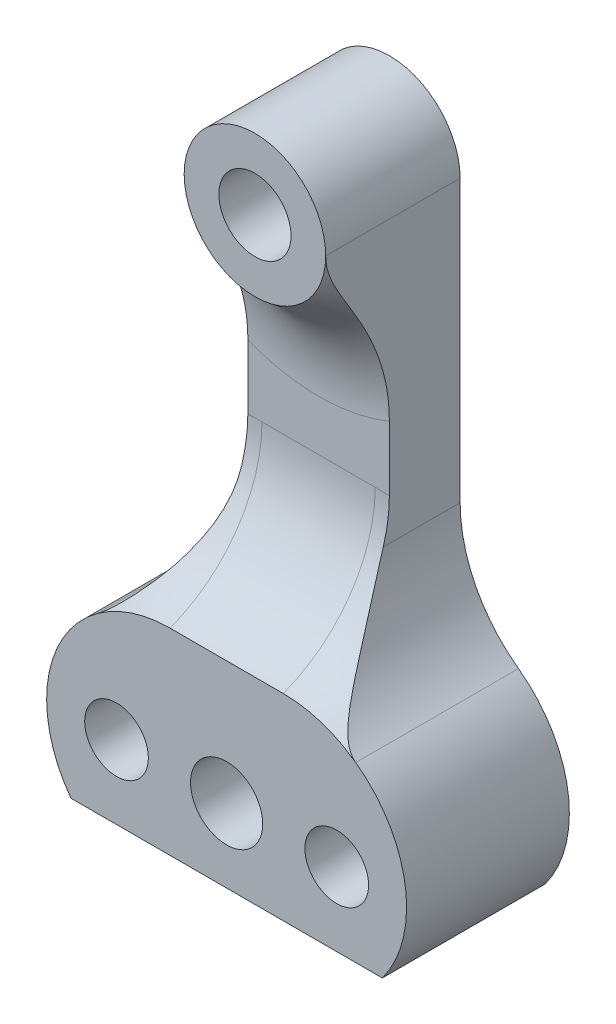
ISO-10303-21;
HEADER;
FILE_DESCRIPTION(('STEP AP214'),'2;1');
FILE_NAME('part.step','',(''),(''),'','','');
FILE_SCHEMA(('AUTOMOTIVE_DESIGN { 1 0 10303 214 1 1 1 1 }'));
ENDSEC;
DATA;
#1=APPLICATION_CONTEXT('core data for automotive mechanical design processes');
#2=APPLICATION_PROTOCOL_DEFINITION('international standard','automotive_design',2000,#1);
#3=PRODUCT_CONTEXT('',#1,'mechanical');
#4=PRODUCT('Part','Part','',(#3));
#5=PRODUCT_RELATED_PRODUCT_CATEGORY('part','',(#4));
#6=PRODUCT_DEFINITION_FORMATION('','',#4);
#7=PRODUCT_DEFINITION_CONTEXT('part definition',#1,'design');
#8=PRODUCT_DEFINITION('design','',#6,#7);
#9=PRODUCT_DEFINITION_SHAPE('','',#8);
#10=(LENGTH_UNIT() NAMED_UNIT(*) SI_UNIT(.MILLI.,.METRE.));
#11=(NAMED_UNIT(*) PLANE_ANGLE_UNIT() SI_UNIT($,.RADIAN.));
#12=(NAMED_UNIT(*) SI_UNIT($,.STERADIAN.) SOLID_ANGLE_UNIT());
#13=UNCERTAINTY_MEASURE_WITH_UNIT(LENGTH_MEASURE(1.E-05),#10,'distance_accuracy_value','');
#14=(GEOMETRIC_REPRESENTATION_CONTEXT(3) GLOBAL_UNCERTAINTY_ASSIGNED_CONTEXT((#13)) GLOBAL_UNIT_ASSIGNED_CONTEXT((#10,
#11,#12)) REPRESENTATION_CONTEXT('',''));
#15=CARTESIAN_POINT('',(0.,0.,0.));
#16=DIRECTION('',(0.,0.,1.));
#17=DIRECTION('',(1.,0.,0.));
#18=AXIS2_PLACEMENT_3D('',#15,#16,#17);
#19=CARTESIAN_POINT('',(0.,0.,0.));
#20=DIRECTION('',(0.,0.,1.));
#21=DIRECTION('',(1.,0.,0.));
#22=AXIS2_PLACEMENT_3D('',#19,#20,#21);
#23=CYLINDRICAL_SURFACE('',#22,2.55);
#24=CARTESIAN_POINT('',(0.,0.,9.5));
#25=DIRECTION('',(0.,0.,1.));
#26=DIRECTION('',(1.,0.,0.));
#27=AXIS2_PLACEMENT_3D('',#24,#25,#26);
#28=CIRCLE('',#27,2.55);
#29=CARTESIAN_POINT('',(2.55,0.,9.5));
#30=VERTEX_POINT('',#29);
#31=EDGE_CURVE('E163',#30,#30,#28,.F.);
#32=ORIENTED_EDGE('',*,*,#31,.F.);
#33=EDGE_LOOP('',(#32));
#34=FACE_BOUND('',#33,.T.);
#35=CARTESIAN_POINT('',(0.,0.,0.));
#36=DIRECTION('',(0.,0.,1.));
#37=DIRECTION('',(1.,0.,0.));
#38=AXIS2_PLACEMENT_3D('',#35,#36,#37);
#39=CIRCLE('',#38,2.55);
#40=CARTESIAN_POINT('',(2.55,0.,0.));
#41=VERTEX_POINT('',#40);
#42=EDGE_CURVE('E189',#41,#41,#39,.T.);
#43=ORIENTED_EDGE('',*,*,#42,.F.);
#44=EDGE_LOOP('',(#43));
#45=FACE_BOUND('',#44,.T.);
#46=ADVANCED_FACE('F38',(#34,#45),#23,.F.);
#47=CARTESIAN_POINT('',(0.,0.,5.));
#48=DIRECTION('',(0.,0.,1.));
#49=DIRECTION('',(1.,0.,0.));
#50=AXIS2_PLACEMENT_3D('',#47,#48,#49);
#51=PLANE('',#50);
#52=DIRECTION('',(0.,-1.,0.));
#53=VECTOR('',#52,1.);
#54=CARTESIAN_POINT('',(5.,0.,5.));
#55=LINE('',#54,#53);
#56=CARTESIAN_POINT('',(5.,-12.3800834182347,5.));
#57=VERTEX_POINT('',#56);
#58=CARTESIAN_POINT('',(5.,-16.9430334058623,5.));
#59=VERTEX_POINT('',#58);
#60=EDGE_CURVE('E150',#57,#59,#55,.T.);
#61=ORIENTED_EDGE('',*,*,#60,.F.);
#62=CARTESIAN_POINT('',(0.,0.,5.));
#63=DIRECTION('',(0.,0.,1.));
#64=DIRECTION('',(1.,0.,0.));
#65=AXIS2_PLACEMENT_3D('',#62,#63,#64);
#66=CIRCLE('',#65,13.351646544245);
#67=CARTESIAN_POINT('',(-5.,-12.3800834182347,5.));
#68=VERTEX_POINT('',#67);
#69=EDGE_CURVE('E260',#57,#68,#66,.F.);
#70=ORIENTED_EDGE('',*,*,#69,.T.);
#71=DIRECTION('',(0.,1.,0.));
#72=VECTOR('',#71,1.);
#73=CARTESIAN_POINT('',(-5.,0.,5.));
#74=LINE('',#73,#72);
#75=CARTESIAN_POINT('',(-5.,-16.9430334058623,5.));
#76=VERTEX_POINT('',#75);
#77=EDGE_CURVE('E151',#76,#68,#74,.T.);
#78=ORIENTED_EDGE('',*,*,#77,.F.);
#79=CARTESIAN_POINT('',(-4.,-35.,5.));
#80=DIRECTION('',(0.,0.,1.));
#81=DIRECTION('',(1.,0.,0.));
#82=AXIS2_PLACEMENT_3D('',#79,#80,#81);
#83=CIRCLE('',#82,18.0846355390925);
#84=CARTESIAN_POINT('',(-4.,-16.9153644609075,5.));
#85=VERTEX_POINT('',#84);
#86=EDGE_CURVE('E210',#76,#85,#83,.F.);
#87=ORIENTED_EDGE('',*,*,#86,.T.);
#88=DIRECTION('',(-1.,0.,0.));
#89=VECTOR('',#88,1.);
#90=CARTESIAN_POINT('',(4.,-16.9153644609075,5.));
#91=LINE('',#90,#89);
#92=CARTESIAN_POINT('',(4.,-16.9153644609075,5.));
#93=VERTEX_POINT('',#92);
#94=EDGE_CURVE('E208',#85,#93,#91,.F.);
#95=ORIENTED_EDGE('',*,*,#94,.T.);
#96=CARTESIAN_POINT('',(4.,-35.,5.));
#97=DIRECTION('',(0.,0.,1.));
#98=DIRECTION('',(1.,0.,0.));
#99=AXIS2_PLACEMENT_3D('',#96,#97,#98);
#100=CIRCLE('',#99,18.0846355390925);
#101=EDGE_CURVE('E212',#93,#59,#100,.F.);
#102=ORIENTED_EDGE('',*,*,#101,.T.);
#103=EDGE_LOOP('',(#61,#70,#78,#87,#95,#102));
#104=FACE_BOUND('',#103,.T.);
#105=ADVANCED_FACE('F292',(#104),#51,.T.);
#106=CARTESIAN_POINT('',(0.,0.,0.));
#107=DIRECTION('',(0.,0.,1.));
#108=DIRECTION('',(1.,0.,0.));
#109=AXIS2_PLACEMENT_3D('',#106,#107,#108);
#110=PLANE('',#109);
#111=CARTESIAN_POINT('',(-7.78,-35.,0.));
#112=DIRECTION('',(0.,0.,-1.));
#113=DIRECTION('',(-1.,0.,0.));
#114=AXIS2_PLACEMENT_3D('',#111,#112,#113);
#115=CIRCLE('',#114,4.);
#116=CARTESIAN_POINT('',(-11.78,-35.,0.));
#117=VERTEX_POINT('',#116);
#118=EDGE_CURVE('E511',#117,#117,#115,.T.);
#119=ORIENTED_EDGE('',*,*,#118,.F.);
#120=EDGE_LOOP('',(#119));
#121=FACE_BOUND('',#120,.T.);
#122=CARTESIAN_POINT('',(7.78,-35.,0.));
#123=DIRECTION('',(0.,0.,-1.));
#124=DIRECTION('',(-1.,0.,0.));
#125=AXIS2_PLACEMENT_3D('',#122,#123,#124);
#126=CIRCLE('',#125,4.);
#127=CARTESIAN_POINT('',(3.78,-35.,0.));
#128=VERTEX_POINT('',#127);
#129=EDGE_CURVE('E521',#128,#128,#126,.T.);
#130=ORIENTED_EDGE('',*,*,#129,.F.);
#131=EDGE_LOOP('',(#130));
#132=FACE_BOUND('',#131,.T.);
#133=CARTESIAN_POINT('',(-4.,-35.,0.));
#134=DIRECTION('',(0.,0.,1.));
#135=DIRECTION('',(1.,0.,0.));
#136=AXIS2_PLACEMENT_3D('',#133,#134,#135);
#137=CIRCLE('',#136,8.71713854149488);
#138=CARTESIAN_POINT('',(-11.0026388508011,-40.1914885607951,0.));
#139=VERTEX_POINT('',#138);
#140=CARTESIAN_POINT('',(-9.12303329613466,-27.9471258200425,0.));
#141=VERTEX_POINT('',#140);
#142=EDGE_CURVE('E164',#139,#141,#137,.F.);
#143=ORIENTED_EDGE('',*,*,#142,.T.);
#144=CARTESIAN_POINT('',(-15.,-19.8563123651631,0.));
#145=DIRECTION('',(0.,0.,1.));
#146=DIRECTION('',(1.,0.,0.));
#147=AXIS2_PLACEMENT_3D('',#144,#145,#146);
#148=CIRCLE('',#147,10.);
#149=CARTESIAN_POINT('',(-5.,-19.8563123651631,0.));
#150=VERTEX_POINT('',#149);
#151=EDGE_CURVE('E141',#141,#150,#148,.T.);
#152=ORIENTED_EDGE('',*,*,#151,.T.);
#153=DIRECTION('',(0.,1.,0.));
#154=VECTOR('',#153,1.);
#155=CARTESIAN_POINT('',(-5.,0.,0.));
#156=LINE('',#155,#154);
#157=CARTESIAN_POINT('',(-5.,0.,0.));
#158=VERTEX_POINT('',#157);
#159=EDGE_CURVE('E134',#150,#158,#156,.T.);
#160=ORIENTED_EDGE('',*,*,#159,.T.);
#161=CARTESIAN_POINT('',(0.,0.,0.));
#162=DIRECTION('',(0.,0.,-1.));
#163=DIRECTION('',(-1.,0.,0.));
#164=AXIS2_PLACEMENT_3D('',#161,#162,#163);
#165=CIRCLE('',#164,5.);
#166=CARTESIAN_POINT('',(5.,0.,0.));
#167=VERTEX_POINT('',#166);
#168=EDGE_CURVE('E139',#158,#167,#165,.T.);
#169=ORIENTED_EDGE('',*,*,#168,.T.);
#170=DIRECTION('',(0.,-1.,0.));
#171=VECTOR('',#170,1.);
#172=CARTESIAN_POINT('',(5.,0.,0.));
#173=LINE('',#172,#171);
#174=CARTESIAN_POINT('',(5.,-19.8563123651631,0.));
#175=VERTEX_POINT('',#174);
#176=EDGE_CURVE('E145',#167,#175,#173,.T.);
#177=ORIENTED_EDGE('',*,*,#176,.T.);
#178=CARTESIAN_POINT('',(15.,-19.8563123651631,0.));
#179=DIRECTION('',(0.,0.,1.));
#180=DIRECTION('',(1.,0.,0.));
#181=AXIS2_PLACEMENT_3D('',#178,#179,#180);
#182=CIRCLE('',#181,10.);
#183=CARTESIAN_POINT('',(9.12303329613466,-27.9471258200425,0.));
#184=VERTEX_POINT('',#183);
#185=EDGE_CURVE('E205',#175,#184,#182,.T.);
#186=ORIENTED_EDGE('',*,*,#185,.T.);
#187=CARTESIAN_POINT('',(4.,-35.,0.));
#188=DIRECTION('',(0.,0.,1.));
#189=DIRECTION('',(1.,0.,0.));
#190=AXIS2_PLACEMENT_3D('',#187,#188,#189);
#191=CIRCLE('',#190,8.71713854149488);
#192=CARTESIAN_POINT('',(11.0026388508011,-40.1914885607951,0.));
#193=VERTEX_POINT('',#192);
#194=EDGE_CURVE('E165',#184,#193,#191,.F.);
#195=ORIENTED_EDGE('',*,*,#194,.T.);
#196=DIRECTION('',(-1.,0.,0.));
#197=VECTOR('',#196,1.);
#198=CARTESIAN_POINT('',(-11.0026388508011,-40.1914885607951,0.));
#199=LINE('',#198,#197);
#200=EDGE_CURVE('E161',#193,#139,#199,.T.);
#201=ORIENTED_EDGE('',*,*,#200,.T.);
#202=EDGE_LOOP('',(#143,#152,#160,#169,#177,#186,#195,#201));
#203=FACE_BOUND('',#202,.T.);
#204=CARTESIAN_POINT('',(0.,-35.,0.));
#205=DIRECTION('',(0.,0.,1.));
#206=DIRECTION('',(1.,0.,0.));
#207=AXIS2_PLACEMENT_3D('',#204,#205,#206);
#208=CIRCLE('',#207,2.55);
#209=CARTESIAN_POINT('',(2.55,-35.,0.));
#210=VERTEX_POINT('',#209);
#211=EDGE_CURVE('E188',#210,#210,#208,.T.);
#212=ORIENTED_EDGE('',*,*,#211,.T.);
#213=EDGE_LOOP('',(#212));
#214=FACE_BOUND('',#213,.T.);
#215=ORIENTED_EDGE('',*,*,#42,.T.);
#216=EDGE_LOOP('',(#215));
#217=FACE_BOUND('',#216,.T.);
#218=ADVANCED_FACE('F136',(#121,#132,#203,#214,#217),#110,.F.);
#219=CARTESIAN_POINT('',(0.,-35.,0.));
#220=DIRECTION('',(0.,0.,1.));
#221=DIRECTION('',(1.,0.,0.));
#222=AXIS2_PLACEMENT_3D('',#219,#220,#221);
#223=CYLINDRICAL_SURFACE('',#222,2.55);
#224=ORIENTED_EDGE('',*,*,#211,.F.);
#225=EDGE_LOOP('',(#224));
#226=FACE_BOUND('',#225,.T.);
#227=CARTESIAN_POINT('',(0.,-35.,11.5));
#228=DIRECTION('',(0.,0.,-1.));
#229=DIRECTION('',(-1.,0.,0.));
#230=AXIS2_PLACEMENT_3D('',#227,#228,#229);
#231=CIRCLE('',#230,2.55);
#232=CARTESIAN_POINT('',(-2.55,-35.,11.5));
#233=VERTEX_POINT('',#232);
#234=EDGE_CURVE('E185',#233,#233,#231,.T.);
#235=ORIENTED_EDGE('',*,*,#234,.F.);
#236=EDGE_LOOP('',(#235));
#237=FACE_BOUND('',#236,.T.);
#238=ADVANCED_FACE('F353',(#226,#237),#223,.F.);
#239=CARTESIAN_POINT('',(0.,-35.,11.5));
#240=DIRECTION('',(0.,0.,1.));
#241=DIRECTION('',(1.,0.,0.));
#242=AXIS2_PLACEMENT_3D('',#239,#240,#241);
#243=PLANE('',#242);
#244=CARTESIAN_POINT('',(-7.78,-35.,11.5));
#245=DIRECTION('',(0.,0.,1.));
#246=DIRECTION('',(1.,0.,0.));
#247=AXIS2_PLACEMENT_3D('',#244,#245,#246);
#248=CIRCLE('',#247,2.25);
#249=CARTESIAN_POINT('',(-5.53,-35.,11.5));
#250=VERTEX_POINT('',#249);
#251=EDGE_CURVE('E518',#250,#250,#248,.T.);
#252=ORIENTED_EDGE('',*,*,#251,.F.);
#253=EDGE_LOOP('',(#252));
#254=FACE_BOUND('',#253,.T.);
#255=CARTESIAN_POINT('',(7.78,-35.,11.5));
#256=DIRECTION('',(0.,0.,1.));
#257=DIRECTION('',(1.,0.,0.));
#258=AXIS2_PLACEMENT_3D('',#255,#256,#257);
#259=CIRCLE('',#258,2.25);
#260=CARTESIAN_POINT('',(10.03,-35.,11.5));
#261=VERTEX_POINT('',#260);
#262=EDGE_CURVE('E268',#261,#261,#259,.T.);
#263=ORIENTED_EDGE('',*,*,#262,.F.);
#264=EDGE_LOOP('',(#263));
#265=FACE_BOUND('',#264,.T.);
#266=ORIENTED_EDGE('',*,*,#234,.T.);
#267=EDGE_LOOP('',(#266));
#268=FACE_BOUND('',#267,.T.);
#269=CARTESIAN_POINT('',(-4.,-35.,11.5));
#270=DIRECTION('',(0.,0.,1.));
#271=DIRECTION('',(1.,0.,0.));
#272=AXIS2_PLACEMENT_3D('',#269,#270,#271);
#273=CIRCLE('',#272,8.71713854149488);
#274=CARTESIAN_POINT('',(-4.,-26.2828614585051,11.5));
#275=VERTEX_POINT('',#274);
#276=CARTESIAN_POINT('',(-9.12303329613466,-27.9471258200425,11.5));
#277=VERTEX_POINT('',#276);
#278=EDGE_CURVE('E169',#275,#277,#273,.T.);
#279=ORIENTED_EDGE('',*,*,#278,.T.);
#280=CARTESIAN_POINT('',(-11.0026388508011,-40.1914885607951,11.5));
#281=VERTEX_POINT('',#280);
#282=EDGE_CURVE('E144',#277,#281,#273,.T.);
#283=ORIENTED_EDGE('',*,*,#282,.T.);
#284=DIRECTION('',(1.,0.,0.));
#285=VECTOR('',#284,1.);
#286=CARTESIAN_POINT('',(-11.0026388508011,-40.1914885607951,11.5));
#287=LINE('',#286,#285);
#288=CARTESIAN_POINT('',(11.0026388508011,-40.1914885607951,11.5));
#289=VERTEX_POINT('',#288);
#290=EDGE_CURVE('E172',#281,#289,#287,.T.);
#291=ORIENTED_EDGE('',*,*,#290,.T.);
#292=CARTESIAN_POINT('',(4.,-35.,11.5));
#293=DIRECTION('',(0.,0.,1.));
#294=DIRECTION('',(1.,0.,0.));
#295=AXIS2_PLACEMENT_3D('',#292,#293,#294);
#296=CIRCLE('',#295,8.71713854149488);
#297=CARTESIAN_POINT('',(9.12303329613466,-27.9471258200425,11.5));
#298=VERTEX_POINT('',#297);
#299=EDGE_CURVE('E176',#289,#298,#296,.T.);
#300=ORIENTED_EDGE('',*,*,#299,.T.);
#301=CARTESIAN_POINT('',(4.,-26.2828614585051,11.5));
#302=VERTEX_POINT('',#301);
#303=EDGE_CURVE('E175',#298,#302,#296,.T.);
#304=ORIENTED_EDGE('',*,*,#303,.T.);
#305=DIRECTION('',(-1.,0.,0.));
#306=VECTOR('',#305,1.);
#307=CARTESIAN_POINT('',(-4.,-26.2828614585051,11.5));
#308=LINE('',#307,#306);
#309=EDGE_CURVE('E179',#302,#275,#308,.T.);
#310=ORIENTED_EDGE('',*,*,#309,.T.);
#311=EDGE_LOOP('',(#279,#283,#291,#300,#304,#310));
#312=FACE_BOUND('',#311,.T.);
#313=ADVANCED_FACE('F307',(#254,#265,#268,#312),#243,.T.);
#314=CARTESIAN_POINT('',(0.,0.,9.5));
#315=DIRECTION('',(0.,0.,1.));
#316=DIRECTION('',(1.,0.,0.));
#317=AXIS2_PLACEMENT_3D('',#314,#315,#316);
#318=PLANE('',#317);
#319=ORIENTED_EDGE('',*,*,#31,.T.);
#320=EDGE_LOOP('',(#319));
#321=FACE_BOUND('',#320,.T.);
#322=CARTESIAN_POINT('',(0.,0.,9.5));
#323=DIRECTION('',(0.,0.,1.));
#324=DIRECTION('',(1.,0.,0.));
#325=AXIS2_PLACEMENT_3D('',#322,#323,#324);
#326=CIRCLE('',#325,5.);
#327=CARTESIAN_POINT('',(5.,0.,9.5));
#328=VERTEX_POINT('',#327);
#329=CARTESIAN_POINT('',(-5.,0.,9.5));
#330=VERTEX_POINT('',#329);
#331=EDGE_CURVE('E160',#328,#330,#326,.T.);
#332=ORIENTED_EDGE('',*,*,#331,.T.);
#333=EDGE_CURVE('E265',#330,#328,#326,.T.);
#334=ORIENTED_EDGE('',*,*,#333,.T.);
#335=EDGE_LOOP('',(#332,#334));
#336=FACE_BOUND('',#335,.T.);
#337=ADVANCED_FACE('F285',(#321,#336),#318,.T.);
#338=CARTESIAN_POINT('',(-11.0026388508011,-40.1914885607951,-28.9888316184846));
#339=DIRECTION('',(0.,-1.,0.));
#340=DIRECTION('',(0.,0.,-1.));
#341=AXIS2_PLACEMENT_3D('',#338,#339,#340);
#342=PLANE('',#341);
#343=ORIENTED_EDGE('',*,*,#200,.F.);
#344=DIRECTION('',(0.,0.,1.));
#345=VECTOR('',#344,1.);
#346=CARTESIAN_POINT('',(11.0026388508011,-40.1914885607951,-28.9888316184846));
#347=LINE('',#346,#345);
#348=EDGE_CURVE('E167',#193,#289,#347,.T.);
#349=ORIENTED_EDGE('',*,*,#348,.T.);
#350=ORIENTED_EDGE('',*,*,#290,.F.);
#351=DIRECTION('',(0.,0.,1.));
#352=VECTOR('',#351,1.);
#353=CARTESIAN_POINT('',(-11.0026388508011,-40.1914885607951,-28.9888316184846));
#354=LINE('',#353,#352);
#355=EDGE_CURVE('E181',#139,#281,#354,.T.);
#356=ORIENTED_EDGE('',*,*,#355,.F.);
#357=EDGE_LOOP('',(#343,#349,#350,#356));
#358=FACE_BOUND('',#357,.T.);
#359=ADVANCED_FACE('F313',(#358),#342,.T.);
#360=CARTESIAN_POINT('',(4.,-35.,-28.9888316184846));
#361=DIRECTION('',(0.,0.,1.));
#362=DIRECTION('',(1.,0.,0.));
#363=AXIS2_PLACEMENT_3D('',#360,#361,#362);
#364=CYLINDRICAL_SURFACE('',#363,8.71713854149488);
#365=DIRECTION('',(0.,0.,1.));
#366=VECTOR('',#365,1.);
#367=CARTESIAN_POINT('',(9.12303329613466,-27.9471258200425,-28.9888316184846));
#368=LINE('',#367,#366);
#369=EDGE_CURVE('E199',#184,#298,#368,.T.);
#370=ORIENTED_EDGE('',*,*,#369,.T.);
#371=ORIENTED_EDGE('',*,*,#299,.F.);
#372=ORIENTED_EDGE('',*,*,#348,.F.);
#373=ORIENTED_EDGE('',*,*,#194,.F.);
#374=EDGE_LOOP('',(#370,#371,#372,#373));
#375=FACE_BOUND('',#374,.T.);
#376=ADVANCED_FACE('F302',(#375),#364,.T.);
#377=CARTESIAN_POINT('',(-4.,-35.,-28.9888316184846));
#378=DIRECTION('',(0.,0.,1.));
#379=DIRECTION('',(1.,0.,0.));
#380=AXIS2_PLACEMENT_3D('',#377,#378,#379);
#381=CYLINDRICAL_SURFACE('',#380,8.71713854149488);
#382=ORIENTED_EDGE('',*,*,#282,.F.);
#383=DIRECTION('',(0.,0.,1.));
#384=VECTOR('',#383,1.);
#385=CARTESIAN_POINT('',(-9.12303329613466,-27.9471258200425,-28.9888316184846));
#386=LINE('',#385,#384);
#387=EDGE_CURVE('E203',#277,#141,#386,.F.);
#388=ORIENTED_EDGE('',*,*,#387,.T.);
#389=ORIENTED_EDGE('',*,*,#142,.F.);
#390=ORIENTED_EDGE('',*,*,#355,.T.);
#391=EDGE_LOOP('',(#382,#388,#389,#390));
#392=FACE_BOUND('',#391,.T.);
#393=ADVANCED_FACE('F316',(#392),#381,.T.);
#394=CARTESIAN_POINT('',(0.,0.,42.3450481901162));
#395=DIRECTION('',(0.,0.,-1.));
#396=DIRECTION('',(-1.,0.,0.));
#397=AXIS2_PLACEMENT_3D('',#394,#395,#396);
#398=CYLINDRICAL_SURFACE('',#397,5.);
#399=DIRECTION('',(0.,0.,-1.));
#400=VECTOR('',#399,1.);
#401=CARTESIAN_POINT('',(-5.,0.,42.3450481901162));
#402=LINE('',#401,#400);
#403=EDGE_CURVE('E59',#330,#158,#402,.T.);
#404=ORIENTED_EDGE('',*,*,#403,.F.);
#405=ORIENTED_EDGE('',*,*,#331,.F.);
#406=DIRECTION('',(0.,0.,-1.));
#407=VECTOR('',#406,1.);
#408=CARTESIAN_POINT('',(5.,0.,42.3450481901162));
#409=LINE('',#408,#407);
#410=EDGE_CURVE('E66',#328,#167,#409,.T.);
#411=ORIENTED_EDGE('',*,*,#410,.T.);
#412=ORIENTED_EDGE('',*,*,#168,.F.);
#413=EDGE_LOOP('',(#404,#405,#411,#412));
#414=FACE_BOUND('',#413,.T.);
#415=ADVANCED_FACE('F153',(#414),#398,.T.);
#416=CARTESIAN_POINT('',(-5.,0.,42.3450481901162));
#417=DIRECTION('',(-1.,0.,0.));
#418=DIRECTION('',(0.,-1.,0.));
#419=AXIS2_PLACEMENT_3D('',#416,#417,#418);
#420=PLANE('',#419);
#421=ORIENTED_EDGE('',*,*,#159,.F.);
#422=DIRECTION('',(0.,0.,-1.));
#423=VECTOR('',#422,1.);
#424=CARTESIAN_POINT('',(-5.,-19.8563123651631,5.));
#425=LINE('',#424,#423);
#426=CARTESIAN_POINT('',(-5.,-19.8563123651631,5.43215127035387));
#427=VERTEX_POINT('',#426);
#428=EDGE_CURVE('E201',#150,#427,#425,.F.);
#429=ORIENTED_EDGE('',*,*,#428,.T.);
#430=CARTESIAN_POINT('',(-5.,-19.8563123651631,5.43215127035387));
#431=CARTESIAN_POINT('',(-5.,-19.6199624145745,5.36045619307963));
#432=CARTESIAN_POINT('',(-5.,-19.380961342965,5.29750945509672));
#433=CARTESIAN_POINT('',(-5.,-18.9002709329881,5.1896808221792));
#434=CARTESIAN_POINT('',(-5.,-18.6586030138574,5.14470343272922));
#435=CARTESIAN_POINT('',(-5.,-18.1726167875473,5.07260357181103));
#436=CARTESIAN_POINT('',(-5.,-17.9282984678437,5.04548118475181));
#437=CARTESIAN_POINT('',(-5.,-17.437003713565,5.00912233782177));
#438=CARTESIAN_POINT('',(-5.,-17.1900200492365,4.99998355358992));
#439=CARTESIAN_POINT('',(-5.,-16.9430334058623,5.));
#440=B_SPLINE_CURVE_WITH_KNOTS('',3,(#430,#431,#432,#433,#434,#435,#436,#437,#438,#439),
.UNSPECIFIED.,.F.,.F.,(4,2,2,2,4),(0.,0.740782737126195,1.4775746260287,2.2143699980685,
2.95515625405431),.UNSPECIFIED.);
#441=EDGE_CURVE('E249',#427,#76,#440,.T.);
#442=ORIENTED_EDGE('',*,*,#441,.T.);
#443=ORIENTED_EDGE('',*,*,#77,.T.);
#444=CARTESIAN_POINT('',(-5.,-12.3800834182347,5.));
#445=CARTESIAN_POINT('',(-5.,-12.2035181842028,4.99999840549545));
#446=CARTESIAN_POINT('',(-5.,-12.0269816403326,5.00402126784642));
#447=CARTESIAN_POINT('',(-5.,-11.6742842672821,5.01994388788278));
#448=CARTESIAN_POINT('',(-5.,-11.4981233954146,5.03184269689178));
#449=CARTESIAN_POINT('',(-5.,-10.9710678889268,5.0790562478808));
#450=CARTESIAN_POINT('',(-5.,-10.6211469895401,5.12588901278066));
#451=CARTESIAN_POINT('',(-5.,-9.92916066705877,5.24799056085634));
#452=CARTESIAN_POINT('',(-5.,-9.5870556655782,5.3230395068316));
#453=CARTESIAN_POINT('',(-5.,-8.909660495126,5.49942109009107));
#454=CARTESIAN_POINT('',(-5.,-8.57437138023339,5.60075775993142));
#455=CARTESIAN_POINT('',(-5.,-7.97298402303867,5.80621601387656));
#456=CARTESIAN_POINT('',(-5.,-7.70551806012467,5.90638556231448));
#457=CARTESIAN_POINT('',(-5.,-7.17634313595766,6.12080341708264));
#458=CARTESIAN_POINT('',(-5.,-6.9146335377661,6.23505015644982));
#459=CARTESIAN_POINT('',(-5.,-6.39668487443849,6.47586668590197));
#460=CARTESIAN_POINT('',(-5.,-6.1404511830092,6.60244795902924));
#461=CARTESIAN_POINT('',(-5.,-5.63327139648342,6.86565293956557));
#462=CARTESIAN_POINT('',(-5.,-5.38232460753804,7.00227531849061));
#463=CARTESIAN_POINT('',(-5.,-4.99581684655964,7.22023308774813));
#464=CARTESIAN_POINT('',(-5.,-4.85879166652506,7.29900066904111));
#465=CARTESIAN_POINT('',(-5.,-4.58574719338118,7.45826214067961));
#466=CARTESIAN_POINT('',(-5.,-4.44972790773116,7.53875604380955));
#467=CARTESIAN_POINT('',(-5.,-4.17825602526108,7.70090155578766));
#468=CARTESIAN_POINT('',(-5.,-4.04280388854625,7.78255393112967));
#469=CARTESIAN_POINT('',(-5.,-3.77211514410337,7.94620521482107));
#470=CARTESIAN_POINT('',(-5.,-3.63687853035502,8.02820411324866));
#471=CARTESIAN_POINT('',(-5.,-3.36598784445081,8.19165565741036));
#472=CARTESIAN_POINT('',(-5.,-3.23033360705168,8.27310803062369));
#473=CARTESIAN_POINT('',(-5.,-2.95794498875351,8.43424650217102));
#474=CARTESIAN_POINT('',(-5.,-2.82121045373574,8.51393234208063));
#475=CARTESIAN_POINT('',(-5.,-2.54599497230289,8.66985605257229));
#476=CARTESIAN_POINT('',(-5.,-2.40751637470881,8.74609803402521));
#477=CARTESIAN_POINT('',(-5.,-2.12770128122132,8.89310819888436));
#478=CARTESIAN_POINT('',(-5.,-1.98636586057473,8.96387839508442));
#479=CARTESIAN_POINT('',(-5.,-1.73035209920845,9.08287468513336));
#480=CARTESIAN_POINT('',(-5.,-1.61641951749605,9.13268929566275));
#481=CARTESIAN_POINT('',(-5.,-1.38567277272736,9.22536806041058));
#482=CARTESIAN_POINT('',(-5.,-1.26885766500793,9.26822990025217));
#483=CARTESIAN_POINT('',(-5.,-1.03304732157865,9.34458191982193));
#484=CARTESIAN_POINT('',(-5.,-0.914072756426784,9.37813487631891));
#485=CARTESIAN_POINT('',(-5.,-0.67355736512349,9.4340014419546));
#486=CARTESIAN_POINT('',(-5.,-0.552019307205083,9.45632658711401));
#487=CARTESIAN_POINT('',(-5.,-0.358592355215246,9.4812941792774));
#488=CARTESIAN_POINT('',(-5.,-0.287248593501562,9.48826445230985));
#489=CARTESIAN_POINT('',(-5.,-0.143944272974572,9.49763873672288));
#490=CARTESIAN_POINT('',(-5.,-0.0719823822725858,9.50002227175153));
#491=CARTESIAN_POINT('',(-5.,0.,9.5));
#492=B_SPLINE_CURVE_WITH_KNOTS('',3,(#444,#445,#446,#447,#448,#449,#450,#451,#452,#453,#454,
#455,#456,#457,#458,#459,#460,#461,#462,#463,#464,#465,#466,#467,#468,#469,#470,#471,#472,#473,
#474,#475,#476,#477,#478,#479,#480,#481,#482,#483,#484,#485,#486,#487,#488,#489,#490,#491),
.UNSPECIFIED.,.F.,.F.,(4,2,2,2,2,2,2,2,2,2,2,2,2,2,2,2,2,2,2,2,2,2,2,4),(0.,0.52959667018566,
1.05912956080555,2.11684002814387,3.16647494253157,4.21627096699878,5.07267525956276,
5.92898430985543,6.78609831350217,7.64309912049908,8.1172423002689,8.59138899255667,
9.06586556542706,9.54032864370225,10.0150129440297,10.4897662332263,10.9639369735917,
11.4379324523076,11.8108050822626,12.1838015771887,12.5542178974807,12.9242528518082,
13.1391667154999,13.3550378030074),.UNSPECIFIED.);
#493=EDGE_CURVE('E52',#68,#330,#492,.T.);
#494=ORIENTED_EDGE('',*,*,#493,.T.);
#495=ORIENTED_EDGE('',*,*,#403,.T.);
#496=EDGE_LOOP('',(#421,#429,#442,#443,#494,#495));
#497=FACE_BOUND('',#496,.T.);
#498=ADVANCED_FACE('F147',(#497),#420,.T.);
#499=CARTESIAN_POINT('',(5.,0.,42.3450481901162));
#500=DIRECTION('',(1.,0.,0.));
#501=DIRECTION('',(0.,1.,0.));
#502=AXIS2_PLACEMENT_3D('',#499,#500,#501);
#503=PLANE('',#502);
#504=ORIENTED_EDGE('',*,*,#410,.F.);
#505=CARTESIAN_POINT('',(5.,0.,9.5));
#506=CARTESIAN_POINT('',(5.,-0.0592428142798295,9.50000893187561));
#507=CARTESIAN_POINT('',(5.,-0.118473386758096,9.49840009437402));
#508=CARTESIAN_POINT('',(5.,-0.236745590187068,9.49202876035376));
#509=CARTESIAN_POINT('',(5.,-0.295787277355098,9.48726731139348));
#510=CARTESIAN_POINT('',(5.,-0.47198188678186,9.46842430181486));
#511=CARTESIAN_POINT('',(5.,-0.588668915313634,9.44978278565232));
#512=CARTESIAN_POINT('',(5.,-0.817280714942397,9.40230736154222));
#513=CARTESIAN_POINT('',(5.,-0.929253979222199,9.37369917418251));
#514=CARTESIAN_POINT('',(5.,-1.15070435141623,9.30800109977393));
#515=CARTESIAN_POINT('',(5.,-1.26018015601402,9.27090689076764));
#516=CARTESIAN_POINT('',(5.,-1.55850668034188,9.15944374051666));
#517=CARTESIAN_POINT('',(5.,-1.74472713956808,9.07811070655369));
#518=CARTESIAN_POINT('',(5.,-2.11117528043778,8.90277292471352));
#519=CARTESIAN_POINT('',(5.,-2.29139412856422,8.80875044569528));
#520=CARTESIAN_POINT('',(5.,-2.64860763230571,8.61316566426022));
#521=CARTESIAN_POINT('',(5.,-2.82558587448294,8.51157379232076));
#522=CARTESIAN_POINT('',(5.,-3.17738741047761,8.30500355423443));
#523=CARTESIAN_POINT('',(5.,-3.35221187301911,8.20002714763805));
#524=CARTESIAN_POINT('',(5.,-3.70533994849458,7.98682567963584));
#525=CARTESIAN_POINT('',(5.,-3.88363176984472,7.87858120057767));
#526=CARTESIAN_POINT('',(5.,-4.2409368484491,7.66323400774345));
#527=CARTESIAN_POINT('',(5.,-4.41995018764066,7.55613142898408));
#528=CARTESIAN_POINT('',(5.,-4.77916536386445,7.34488124287007));
#529=CARTESIAN_POINT('',(5.,-4.9593635006209,7.24072738151431));
#530=CARTESIAN_POINT('',(5.,-5.3219844658955,7.03636676638719));
#531=CARTESIAN_POINT('',(5.,-5.50440720992804,6.93615986332677));
#532=CARTESIAN_POINT('',(5.,-5.87102664148322,6.74120705665234));
#533=CARTESIAN_POINT('',(5.,-6.05521041520144,6.64643700007078));
#534=CARTESIAN_POINT('',(5.,-6.42646106670012,6.46272565940431));
#535=CARTESIAN_POINT('',(5.,-6.6135280036788,6.37378449519793));
#536=CARTESIAN_POINT('',(5.,-7.17954810405599,6.11678795147897));
#537=CARTESIAN_POINT('',(5.,-7.56311519877177,5.95867079781859));
#538=CARTESIAN_POINT('',(5.,-8.33956770710378,5.67536373698116));
#539=CARTESIAN_POINT('',(5.,-8.73237915775033,5.54997258997727));
#540=CARTESIAN_POINT('',(5.,-9.52756609389128,5.33527822520325));
#541=CARTESIAN_POINT('',(5.,-9.92993463994665,5.24594962223819));
#542=CARTESIAN_POINT('',(5.,-10.6729655466423,5.11861603543273));
#543=CARTESIAN_POINT('',(5.,-11.0125736018206,5.0744913501865));
#544=CARTESIAN_POINT('',(5.,-11.5240683986888,5.03000382038349));
#545=CARTESIAN_POINT('',(5.,-11.6950567236482,5.01879095517126));
#546=CARTESIAN_POINT('',(5.,-12.0373833126818,5.00378742020659));
#547=CARTESIAN_POINT('',(5.,-12.2087216253426,4.99999786261868));
#548=CARTESIAN_POINT('',(5.,-12.3800834182347,5.));
#549=B_SPLINE_CURVE_WITH_KNOTS('',3,(#505,#506,#507,#508,#509,#510,#511,#512,#513,#514,#515,
#516,#517,#518,#519,#520,#521,#522,#523,#524,#525,#526,#527,#528,#529,#530,#531,#532,#533,#534,
#535,#536,#537,#538,#539,#540,#541,#542,#543,#544,#545,#546,#547,#548),.UNSPECIFIED.,.F.,.F.,(4,
2,2,2,2,2,2,2,2,2,2,2,2,2,2,2,2,2,2,2,2,4),(0.,0.177683781197213,0.355308550750479,
0.709171510429659,1.05549186916257,1.40198900417042,2.01071252515322,2.62029560475884,
3.23239930772968,3.84415476847003,4.46989024990624,5.09569891471709,5.72006208176829,
6.34440161029239,6.96570972074268,7.58703060517169,8.83037167554731,10.0658767292057,
11.300510561635,12.3266475481923,12.8405707795262,13.3545710012691),.UNSPECIFIED.);
#550=EDGE_CURVE('E11',#328,#57,#549,.T.);
#551=ORIENTED_EDGE('',*,*,#550,.T.);
#552=ORIENTED_EDGE('',*,*,#60,.T.);
#553=CARTESIAN_POINT('',(5.,-16.9430334058623,5.));
#554=CARTESIAN_POINT('',(5.,-17.1900200492365,4.99998355358992));
#555=CARTESIAN_POINT('',(5.,-17.437003713565,5.00912233782177));
#556=CARTESIAN_POINT('',(5.,-17.9282984678437,5.04548118475181));
#557=CARTESIAN_POINT('',(5.,-18.1726167875473,5.07260357181103));
#558=CARTESIAN_POINT('',(5.,-18.6586030138574,5.14470343272922));
#559=CARTESIAN_POINT('',(5.,-18.9002709329881,5.1896808221792));
#560=CARTESIAN_POINT('',(5.,-19.380961342965,5.29750945509672));
#561=CARTESIAN_POINT('',(5.,-19.6199624145745,5.36045619307963));
#562=CARTESIAN_POINT('',(5.,-19.8563123651631,5.43215127035388));
#563=B_SPLINE_CURVE_WITH_KNOTS('',3,(#553,#554,#555,#556,#557,#558,#559,#560,#561,#562),
.UNSPECIFIED.,.F.,.F.,(4,2,2,2,4),(0.,0.740786255985811,1.47758162802561,2.21437351692811,
2.95515625405431),.UNSPECIFIED.);
#564=CARTESIAN_POINT('',(5.,-19.8563123651631,5.43215127035387));
#565=VERTEX_POINT('',#564);
#566=EDGE_CURVE('E215',#59,#565,#563,.T.);
#567=ORIENTED_EDGE('',*,*,#566,.T.);
#568=DIRECTION('',(0.,0.,-1.));
#569=VECTOR('',#568,1.);
#570=CARTESIAN_POINT('',(5.,-19.8563123651631,0.));
#571=LINE('',#570,#569);
#572=EDGE_CURVE('E192',#565,#175,#571,.T.);
#573=ORIENTED_EDGE('',*,*,#572,.T.);
#574=ORIENTED_EDGE('',*,*,#176,.F.);
#575=EDGE_LOOP('',(#504,#551,#552,#567,#573,#574));
#576=FACE_BOUND('',#575,.T.);
#577=ADVANCED_FACE('F234',(#576),#503,.T.);
#578=CARTESIAN_POINT('',(15.,-19.8563123651631,-28.9888316184846));
#579=DIRECTION('',(0.,0.,1.));
#580=DIRECTION('',(1.,0.,0.));
#581=AXIS2_PLACEMENT_3D('',#578,#579,#580);
#582=CYLINDRICAL_SURFACE('',#581,10.);
#583=ORIENTED_EDGE('',*,*,#572,.F.);
#584=CARTESIAN_POINT('',(5.,-19.8563123651631,5.43215127035387));
#585=CARTESIAN_POINT('',(4.99999834697394,-19.9759191078667,5.46842161430926));
#586=CARTESIAN_POINT('',(5.00214624423919,-20.0948352041447,5.50688335322549));
#587=CARTESIAN_POINT('',(5.01057597429449,-20.3310404561105,5.58804547100294));
#588=CARTESIAN_POINT('',(5.01685704894965,-20.4483299061409,5.63074507130792));
#589=CARTESIAN_POINT('',(5.04162105203947,-20.7969970334518,5.7648294331228));
#590=CARTESIAN_POINT('',(5.06602608130356,-21.0256462641075,5.86234370451516));
#591=CARTESIAN_POINT('',(5.12869650706263,-21.4710391294565,6.07086711243934));
#592=CARTESIAN_POINT('',(5.16678138920477,-21.6878973182433,6.18168852780825));
#593=CARTESIAN_POINT('',(5.25531168714589,-22.1119710469674,6.41626437934502));
#594=CARTESIAN_POINT('',(5.30576337603238,-22.3191816294622,6.5400253608055));
#595=CARTESIAN_POINT('',(5.43731790413463,-22.7949810903325,6.84464243737485));
#596=CARTESIAN_POINT('',(5.52294785848966,-23.0593144722591,7.0301950264102));
#597=CARTESIAN_POINT('',(5.71086545318474,-23.5692510647739,7.41779411296668));
#598=CARTESIAN_POINT('',(5.81315937000721,-23.8148471665869,7.61984681089874));
#599=CARTESIAN_POINT('',(6.03246835915503,-24.2893667208674,8.03711715469469));
#600=CARTESIAN_POINT('',(6.14953967138249,-24.5182209024886,8.25238338957106));
#601=CARTESIAN_POINT('',(6.39684922779192,-24.9602350517473,8.69108819544934));
#602=CARTESIAN_POINT('',(6.52708443894486,-25.17339861511,8.91452487640134));
#603=CARTESIAN_POINT('',(6.72901759894777,-25.4781067797096,9.24600063655797));
#604=CARTESIAN_POINT('',(6.79541057803018,-25.5745637965651,9.35282379473989));
#605=CARTESIAN_POINT('',(6.93152972436133,-25.7650780955484,9.56648799888897));
#606=CARTESIAN_POINT('',(7.00125577319725,-25.859135462746,9.67332904408648));
#607=CARTESIAN_POINT('',(7.14448992290731,-26.0453972590334,9.88623430704547));
#608=CARTESIAN_POINT('',(7.21800033033603,-26.1376005092815,9.99229800493632));
#609=CARTESIAN_POINT('',(7.36941011339889,-26.3206934145187,10.2023934256043));
#610=CARTESIAN_POINT('',(7.44730878813869,-26.4115832763847,10.306425469323));
#611=CARTESIAN_POINT('',(7.59086962516477,-26.5729895017233,10.4883439127953));
#612=CARTESIAN_POINT('',(7.65547626357554,-26.64360918387,10.5669674183382));
#613=CARTESIAN_POINT('',(7.7886785334889,-26.7849686832509,10.7206315609605));
#614=CARTESIAN_POINT('',(7.85727307612438,-26.8557084626199,10.7956731659548));
#615=CARTESIAN_POINT('',(7.99924521027617,-26.9977056738975,10.9401747580115));
#616=CARTESIAN_POINT('',(8.07261233685975,-27.068961687778,11.0096462580325));
#617=CARTESIAN_POINT('',(8.22534445207273,-27.2126030155124,11.1402213801913));
#618=CARTESIAN_POINT('',(8.30470102357683,-27.2849866351564,11.2013364181676));
#619=CARTESIAN_POINT('',(8.46711356590453,-27.4281425076939,11.3085279665723));
#620=CARTESIAN_POINT('',(8.54986455697758,-27.4988505733617,11.3551373645321));
#621=CARTESIAN_POINT('',(8.72212946018649,-27.6409535855603,11.4310188887381));
#622=CARTESIAN_POINT('',(8.81160642819274,-27.7123431341006,11.460378889337));
#623=CARTESIAN_POINT('',(8.93949112449649,-27.8107008230382,11.4855958193539));
#624=CARTESIAN_POINT('',(8.97572421696032,-27.8381781013829,11.4909634624619));
#625=CARTESIAN_POINT('',(9.04891204290667,-27.8928942230004,11.4981776265948));
#626=CARTESIAN_POINT('',(9.08586883843213,-27.9201319133116,11.5000119083384));
#627=CARTESIAN_POINT('',(9.12303329613466,-27.9471258200425,11.5));
#628=B_SPLINE_CURVE_WITH_KNOTS('',3,(#584,#585,#586,#587,#588,#589,#590,#591,#592,#593,#594,
#595,#596,#597,#598,#599,#600,#601,#602,#603,#604,#605,#606,#607,#608,#609,#610,#611,#612,#613,
#614,#615,#616,#617,#618,#619,#620,#621,#622,#623,#624,#625,#626,#627),.UNSPECIFIED.,.F.,.F.,(4,
2,2,2,2,2,2,2,2,2,2,2,2,2,2,2,2,2,2,2,2,4),(0.,0.374870503062781,0.74967226404307,
1.49779949444993,2.23639702249818,2.97536998375759,3.97608317218995,4.97717415450388,
5.98219695572861,6.98698872017655,7.46245933799387,7.93791307646491,8.41366011488889,
8.88933138122783,9.26084755883909,9.63226276888055,10.0028893652154,10.3730044756085,
10.7272336575757,11.079642265912,11.2168846842617,11.3546016504934),.UNSPECIFIED.);
#629=EDGE_CURVE('E223',#565,#298,#628,.T.);
#630=ORIENTED_EDGE('',*,*,#629,.T.);
#631=ORIENTED_EDGE('',*,*,#369,.F.);
#632=ORIENTED_EDGE('',*,*,#185,.F.);
#633=EDGE_LOOP('',(#583,#630,#631,#632));
#634=FACE_BOUND('',#633,.T.);
#635=ADVANCED_FACE('F239',(#634),#582,.F.);
#636=CARTESIAN_POINT('',(-15.,-19.8563123651631,-28.9888316184846));
#637=DIRECTION('',(0.,0.,1.));
#638=DIRECTION('',(1.,0.,0.));
#639=AXIS2_PLACEMENT_3D('',#636,#637,#638);
#640=CYLINDRICAL_SURFACE('',#639,10.);
#641=ORIENTED_EDGE('',*,*,#151,.F.);
#642=ORIENTED_EDGE('',*,*,#387,.F.);
#643=CARTESIAN_POINT('',(-9.12303329613466,-27.9471258200425,11.5));
#644=CARTESIAN_POINT('',(-9.0764113715504,-27.9132682247074,11.5000514371017));
#645=CARTESIAN_POINT('',(-9.03011633012495,-27.8790180502772,11.4971396361444));
#646=CARTESIAN_POINT('',(-8.93866251961999,-27.8101431574128,11.4857978043171));
#647=CARTESIAN_POINT('',(-8.89350125329361,-27.7755195569947,11.4773812574789));
#648=CARTESIAN_POINT('',(-8.80554477589484,-27.7069032840578,11.4556760065544));
#649=CARTESIAN_POINT('',(-8.76271936836642,-27.6729134919957,11.4424985814357));
#650=CARTESIAN_POINT('',(-8.67855302675929,-27.6050047129115,11.4118384840162));
#651=CARTESIAN_POINT('',(-8.63721308892494,-27.5710857872645,11.3943529820108));
#652=CARTESIAN_POINT('',(-8.53338239954346,-27.4845261556332,11.3448705550382));
#653=CARTESIAN_POINT('',(-8.47201924956009,-27.432044243965,11.310232271305));
#654=CARTESIAN_POINT('',(-8.35298079963814,-27.3278186490897,11.2342064450147));
#655=CARTESIAN_POINT('',(-8.29530805203938,-27.2760754956299,11.1928143001426));
#656=CARTESIAN_POINT('',(-8.18255078452299,-27.1726172086848,11.1044883964073));
#657=CARTESIAN_POINT('',(-8.12750915616534,-27.1209110158546,11.0574901419021));
#658=CARTESIAN_POINT('',(-8.02039398682503,-27.0180581138004,10.9597574877027));
#659=CARTESIAN_POINT('',(-7.96831933888911,-26.9669112017459,10.9090244978119));
#660=CARTESIAN_POINT('',(-7.81257411639174,-26.8106683134705,10.749379784271));
#661=CARTESIAN_POINT('',(-7.71297470399565,-26.7060883259264,10.6360137242578));
#662=CARTESIAN_POINT('',(-7.52157602084517,-26.4965885771057,10.403118877069));
#663=CARTESIAN_POINT('',(-7.42978360664972,-26.3916685994807,10.2835848178318));
#664=CARTESIAN_POINT('',(-7.25210905166519,-26.1800224857467,10.0411270664165));
#665=CARTESIAN_POINT('',(-7.16624123409268,-26.0732926996856,9.91819610123327));
#666=CARTESIAN_POINT('',(-6.99956685143047,-25.8572846601553,9.67114573437119));
#667=CARTESIAN_POINT('',(-6.91876064517641,-25.7480062267553,9.54702624915148));
#668=CARTESIAN_POINT('',(-6.76163135201382,-25.5262098580873,9.29901909775034));
#669=CARTESIAN_POINT('',(-6.68530528424938,-25.4136941527441,9.17513133176734));
#670=CARTESIAN_POINT('',(-6.53675712788114,-25.1847383242443,8.92851668767492));
#671=CARTESIAN_POINT('',(-6.46453544230207,-25.068297817479,8.80578992455161));
#672=CARTESIAN_POINT('',(-6.25403341050093,-24.7126521788889,8.4410095587017));
#673=CARTESIAN_POINT('',(-6.12165362830769,-24.4667543875236,8.20193363437003));
#674=CARTESIAN_POINT('',(-5.90468831143164,-24.0181417387157,7.79563706987735));
#675=CARTESIAN_POINT('',(-5.81641939545422,-23.8199625891893,7.62537265409401));
#676=CARTESIAN_POINT('',(-5.65050159218125,-23.4109719498327,7.29487573035233));
#677=CARTESIAN_POINT('',(-5.57285614764839,-23.200156396586,7.13464648358355));
#678=CARTESIAN_POINT('',(-5.43009226843285,-22.7664296345163,6.82721242714691));
#679=CARTESIAN_POINT('',(-5.36492772393374,-22.5435670072087,6.67996080597633));
#680=CARTESIAN_POINT('',(-5.24872427503206,-22.0853074371997,6.40017651168695));
#681=CARTESIAN_POINT('',(-5.19767807593114,-21.8499170426254,6.26763625873932));
#682=CARTESIAN_POINT('',(-5.13002388854032,-21.4698470128677,6.07213102587358));
#683=CARTESIAN_POINT('',(-5.1079902749705,-21.3290148759116,6.00349027271827));
#684=CARTESIAN_POINT('',(-5.06971762084252,-21.0438233308387,5.87224222938367));
#685=CARTESIAN_POINT('',(-5.05347704705788,-20.8994648668478,5.80963334597424));
#686=CARTESIAN_POINT('',(-5.02712286347898,-20.6068990902444,5.69054387492274));
#687=CARTESIAN_POINT('',(-5.01703802655546,-20.4586770293106,5.63409306421674));
#688=CARTESIAN_POINT('',(-5.00347056161219,-20.1594436893698,5.52795436278745));
#689=CARTESIAN_POINT('',(-4.99999164185516,-20.0084308917643,5.47827028511835));
#690=CARTESIAN_POINT('',(-5.,-19.8563123651631,5.43215127035388));
#691=B_SPLINE_CURVE_WITH_KNOTS('',3,(#643,#644,#645,#646,#647,#648,#649,#650,#651,#652,#653,
#654,#655,#656,#657,#658,#659,#660,#661,#662,#663,#664,#665,#666,#667,#668,#669,#670,#671,#672,
#673,#674,#675,#676,#677,#678,#679,#680,#681,#682,#683,#684,#685,#686,#687,#688,#689,#690),
.UNSPECIFIED.,.F.,.F.,(4,2,2,2,2,2,2,2,2,2,2,2,2,2,2,2,2,2,2,2,2,2,2,4),(0.,0.17272715269459,
0.345032781975045,0.513547099108806,0.682172399165036,0.945280491339479,1.20856862905826,
1.47524711666562,1.74182544851924,2.29211390727716,2.84288077529204,3.39493561752112,
3.94702955269047,4.49875188875158,5.05052830722944,6.15222785799825,6.97901664751842,
7.80607274414989,8.63001177038785,9.45352428327963,9.92793316631622,10.4022163956481,
10.8786998537749,11.3554507091521),.UNSPECIFIED.);
#692=EDGE_CURVE('E305',#277,#427,#691,.T.);
#693=ORIENTED_EDGE('',*,*,#692,.T.);
#694=ORIENTED_EDGE('',*,*,#428,.F.);
#695=EDGE_LOOP('',(#641,#642,#693,#694));
#696=FACE_BOUND('',#695,.T.);
#697=ADVANCED_FACE('F319',(#696),#640,.F.);
#698=CARTESIAN_POINT('',(-4.,-35.,15.));
#699=DIRECTION('',(0.,0.,1.));
#700=DIRECTION('',(1.,0.,0.));
#701=AXIS2_PLACEMENT_3D('',#698,#699,#700);
#702=TOROIDAL_SURFACE('',#701,18.0846355390925,10.);
#703=ORIENTED_EDGE('',*,*,#692,.F.);
#704=ORIENTED_EDGE('',*,*,#278,.F.);
#705=CARTESIAN_POINT('',(-4.,-16.9153644609075,15.));
#706=DIRECTION('',(-1.,0.,0.));
#707=DIRECTION('',(0.,0.,1.));
#708=AXIS2_PLACEMENT_3D('',#705,#706,#707);
#709=CIRCLE('',#708,10.);
#710=EDGE_CURVE('E263',#85,#275,#709,.T.);
#711=ORIENTED_EDGE('',*,*,#710,.F.);
#712=ORIENTED_EDGE('',*,*,#86,.F.);
#713=ORIENTED_EDGE('',*,*,#441,.F.);
#714=EDGE_LOOP('',(#703,#704,#711,#712,#713));
#715=FACE_BOUND('',#714,.T.);
#716=ADVANCED_FACE('F325',(#715),#702,.F.);
#717=CARTESIAN_POINT('',(-4.,-16.9153644609075,15.));
#718=DIRECTION('',(1.,0.,0.));
#719=DIRECTION('',(0.,0.,-1.));
#720=AXIS2_PLACEMENT_3D('',#717,#718,#719);
#721=CYLINDRICAL_SURFACE('',#720,10.);
#722=ORIENTED_EDGE('',*,*,#710,.T.);
#723=ORIENTED_EDGE('',*,*,#309,.F.);
#724=CARTESIAN_POINT('',(4.,-16.9153644609075,15.));
#725=DIRECTION('',(-1.,0.,0.));
#726=DIRECTION('',(0.,0.,1.));
#727=AXIS2_PLACEMENT_3D('',#724,#725,#726);
#728=CIRCLE('',#727,10.);
#729=EDGE_CURVE('E266',#93,#302,#728,.T.);
#730=ORIENTED_EDGE('',*,*,#729,.F.);
#731=ORIENTED_EDGE('',*,*,#94,.F.);
#732=EDGE_LOOP('',(#722,#723,#730,#731));
#733=FACE_BOUND('',#732,.T.);
#734=ADVANCED_FACE('F328',(#733),#721,.F.);
#735=CARTESIAN_POINT('',(4.,-35.,15.));
#736=DIRECTION('',(0.,0.,1.));
#737=DIRECTION('',(1.,0.,0.));
#738=AXIS2_PLACEMENT_3D('',#735,#736,#737);
#739=TOROIDAL_SURFACE('',#738,18.0846355390925,10.);
#740=ORIENTED_EDGE('',*,*,#729,.T.);
#741=ORIENTED_EDGE('',*,*,#303,.F.);
#742=ORIENTED_EDGE('',*,*,#629,.F.);
#743=ORIENTED_EDGE('',*,*,#566,.F.);
#744=ORIENTED_EDGE('',*,*,#101,.F.);
#745=EDGE_LOOP('',(#740,#741,#742,#743,#744));
#746=FACE_BOUND('',#745,.T.);
#747=ADVANCED_FACE('F230',(#746),#739,.F.);
#748=CARTESIAN_POINT('',(0.,0.,15.));
#749=DIRECTION('',(0.,0.,1.));
#750=DIRECTION('',(1.,0.,0.));
#751=AXIS2_PLACEMENT_3D('',#748,#749,#750);
#752=TOROIDAL_SURFACE('',#751,13.351646544245,10.);
#753=ORIENTED_EDGE('',*,*,#550,.F.);
#754=ORIENTED_EDGE('',*,*,#333,.F.);
#755=ORIENTED_EDGE('',*,*,#493,.F.);
#756=ORIENTED_EDGE('',*,*,#69,.F.);
#757=EDGE_LOOP('',(#753,#754,#755,#756));
#758=FACE_BOUND('',#757,.T.);
#759=ADVANCED_FACE('F40',(#758),#752,.F.);
#760=CARTESIAN_POINT('',(7.78,-35.,0.));
#761=DIRECTION('',(0.,0.,-1.));
#762=DIRECTION('',(-1.,0.,0.));
#763=AXIS2_PLACEMENT_3D('',#760,#761,#762);
#764=CYLINDRICAL_SURFACE('',#763,2.25);
#765=CARTESIAN_POINT('',(7.78,-35.,4.));
#766=DIRECTION('',(0.,0.,-1.));
#767=DIRECTION('',(-1.,0.,0.));
#768=AXIS2_PLACEMENT_3D('',#765,#766,#767);
#769=CIRCLE('',#768,2.25);
#770=CARTESIAN_POINT('',(5.53,-35.,4.));
#771=VERTEX_POINT('',#770);
#772=EDGE_CURVE('E274',#771,#771,#769,.T.);
#773=ORIENTED_EDGE('',*,*,#772,.T.);
#774=EDGE_LOOP('',(#773));
#775=FACE_BOUND('',#774,.T.);
#776=ORIENTED_EDGE('',*,*,#262,.T.);
#777=EDGE_LOOP('',(#776));
#778=FACE_BOUND('',#777,.T.);
#779=ADVANCED_FACE('F240',(#775,#778),#764,.F.);
#780=CARTESIAN_POINT('',(10.03,-35.,4.));
#781=DIRECTION('',(0.,0.,1.));
#782=DIRECTION('',(1.,0.,0.));
#783=AXIS2_PLACEMENT_3D('',#780,#781,#782);
#784=PLANE('',#783);
#785=ORIENTED_EDGE('',*,*,#772,.F.);
#786=EDGE_LOOP('',(#785));
#787=FACE_BOUND('',#786,.T.);
#788=CARTESIAN_POINT('',(7.78,-35.,4.));
#789=DIRECTION('',(0.,0.,-1.));
#790=DIRECTION('',(-1.,0.,0.));
#791=AXIS2_PLACEMENT_3D('',#788,#789,#790);
#792=CIRCLE('',#791,4.);
#793=CARTESIAN_POINT('',(3.78,-35.,4.));
#794=VERTEX_POINT('',#793);
#795=EDGE_CURVE('E279',#794,#794,#792,.T.);
#796=ORIENTED_EDGE('',*,*,#795,.T.);
#797=EDGE_LOOP('',(#796));
#798=FACE_BOUND('',#797,.T.);
#799=ADVANCED_FACE('F453',(#787,#798),#784,.F.);
#800=CARTESIAN_POINT('',(7.78,-35.,0.));
#801=DIRECTION('',(0.,0.,-1.));
#802=DIRECTION('',(-1.,0.,0.));
#803=AXIS2_PLACEMENT_3D('',#800,#801,#802);
#804=CYLINDRICAL_SURFACE('',#803,4.);
#805=ORIENTED_EDGE('',*,*,#795,.F.);
#806=EDGE_LOOP('',(#805));
#807=FACE_BOUND('',#806,.T.);
#808=ORIENTED_EDGE('',*,*,#129,.T.);
#809=EDGE_LOOP('',(#808));
#810=FACE_BOUND('',#809,.T.);
#811=ADVANCED_FACE('F462',(#807,#810),#804,.F.);
#812=CARTESIAN_POINT('',(-7.78,-35.,0.));
#813=DIRECTION('',(0.,0.,-1.));
#814=DIRECTION('',(-1.,0.,0.));
#815=AXIS2_PLACEMENT_3D('',#812,#813,#814);
#816=CYLINDRICAL_SURFACE('',#815,2.25);
#817=CARTESIAN_POINT('',(-7.78,-35.,4.));
#818=DIRECTION('',(0.,0.,-1.));
#819=DIRECTION('',(-1.,0.,0.));
#820=AXIS2_PLACEMENT_3D('',#817,#818,#819);
#821=CIRCLE('',#820,2.25);
#822=CARTESIAN_POINT('',(-10.03,-35.,4.));
#823=VERTEX_POINT('',#822);
#824=EDGE_CURVE('E513',#823,#823,#821,.T.);
#825=ORIENTED_EDGE('',*,*,#824,.T.);
#826=EDGE_LOOP('',(#825));
#827=FACE_BOUND('',#826,.T.);
#828=ORIENTED_EDGE('',*,*,#251,.T.);
#829=EDGE_LOOP('',(#828));
#830=FACE_BOUND('',#829,.T.);
#831=ADVANCED_FACE('F471',(#827,#830),#816,.F.);
#832=CARTESIAN_POINT('',(-5.53,-35.,4.));
#833=DIRECTION('',(0.,0.,1.));
#834=DIRECTION('',(1.,0.,0.));
#835=AXIS2_PLACEMENT_3D('',#832,#833,#834);
#836=PLANE('',#835);
#837=ORIENTED_EDGE('',*,*,#824,.F.);
#838=EDGE_LOOP('',(#837));
#839=FACE_BOUND('',#838,.T.);
#840=CARTESIAN_POINT('',(-7.78,-35.,4.));
#841=DIRECTION('',(0.,0.,-1.));
#842=DIRECTION('',(-1.,0.,0.));
#843=AXIS2_PLACEMENT_3D('',#840,#841,#842);
#844=CIRCLE('',#843,4.);
#845=CARTESIAN_POINT('',(-11.78,-35.,4.));
#846=VERTEX_POINT('',#845);
#847=EDGE_CURVE('E508',#846,#846,#844,.T.);
#848=ORIENTED_EDGE('',*,*,#847,.T.);
#849=EDGE_LOOP('',(#848));
#850=FACE_BOUND('',#849,.T.);
#851=ADVANCED_FACE('F481',(#839,#850),#836,.F.);
#852=CARTESIAN_POINT('',(-7.78,-35.,0.));
#853=DIRECTION('',(0.,0.,-1.));
#854=DIRECTION('',(-1.,0.,0.));
#855=AXIS2_PLACEMENT_3D('',#852,#853,#854);
#856=CYLINDRICAL_SURFACE('',#855,4.);
#857=ORIENTED_EDGE('',*,*,#847,.F.);
#858=EDGE_LOOP('',(#857));
#859=FACE_BOUND('',#858,.T.);
#860=ORIENTED_EDGE('',*,*,#118,.T.);
#861=EDGE_LOOP('',(#860));
#862=FACE_BOUND('',#861,.T.);
#863=ADVANCED_FACE('F491',(#859,#862),#856,.F.);
#864=CLOSED_SHELL('',(#46,#105,#218,#238,#313,#337,#359,#376,#393,#415,#498,#577,#635,#697,#716,
#734,#747,#759,#779,#799,#811,#831,#851,#863));
#865=MANIFOLD_SOLID_BREP('B2',#864);
#866=ADVANCED_BREP_SHAPE_REPRESENTATION('',(#18,#865),#14);
#867=SHAPE_DEFINITION_REPRESENTATION(#9,#866);
ENDSEC;
END-ISO-10303-21;
